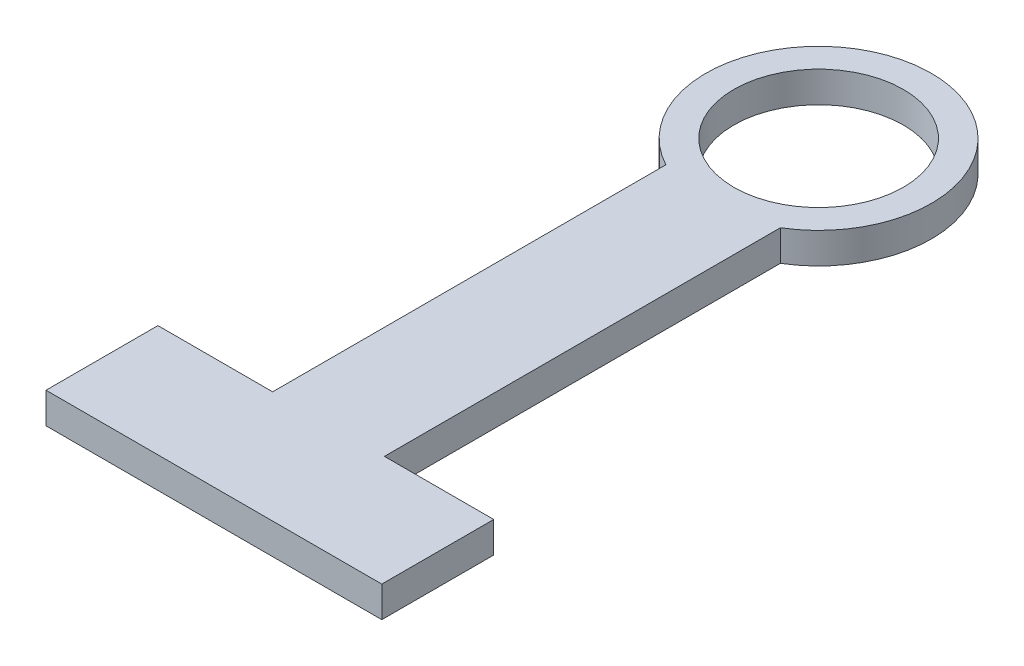
ISO-10303-21;
HEADER;
FILE_DESCRIPTION(('STEP AP214'),'2;1');
FILE_NAME('part.step','',(''),(''),'','','');
FILE_SCHEMA(('AUTOMOTIVE_DESIGN { 1 0 10303 214 1 1 1 1 }'));
ENDSEC;
DATA;
#1=APPLICATION_CONTEXT('core data for automotive mechanical design processes');
#2=APPLICATION_PROTOCOL_DEFINITION('international standard','automotive_design',2000,#1);
#3=PRODUCT_CONTEXT('',#1,'mechanical');
#4=PRODUCT('Part','Part','',(#3));
#5=PRODUCT_RELATED_PRODUCT_CATEGORY('part','',(#4));
#6=PRODUCT_DEFINITION_FORMATION('','',#4);
#7=PRODUCT_DEFINITION_CONTEXT('part definition',#1,'design');
#8=PRODUCT_DEFINITION('design','',#6,#7);
#9=PRODUCT_DEFINITION_SHAPE('','',#8);
#10=(LENGTH_UNIT() NAMED_UNIT(*) SI_UNIT(.MILLI.,.METRE.));
#11=(NAMED_UNIT(*) PLANE_ANGLE_UNIT() SI_UNIT($,.RADIAN.));
#12=(NAMED_UNIT(*) SI_UNIT($,.STERADIAN.) SOLID_ANGLE_UNIT());
#13=UNCERTAINTY_MEASURE_WITH_UNIT(LENGTH_MEASURE(1.E-05),#10,'distance_accuracy_value','');
#14=(GEOMETRIC_REPRESENTATION_CONTEXT(3) GLOBAL_UNCERTAINTY_ASSIGNED_CONTEXT((#13)) GLOBAL_UNIT_ASSIGNED_CONTEXT((#10,
#11,#12)) REPRESENTATION_CONTEXT('',''));
#15=CARTESIAN_POINT('',(0.,0.,0.));
#16=DIRECTION('',(0.,0.,1.));
#17=DIRECTION('',(1.,0.,0.));
#18=AXIS2_PLACEMENT_3D('',#15,#16,#17);
#19=CARTESIAN_POINT('',(13.2312792284211,7.,0.));
#20=DIRECTION('',(1.,0.,0.));
#21=DIRECTION('',(0.,0.,-1.));
#22=AXIS2_PLACEMENT_3D('',#19,#20,#21);
#23=PLANE('',#22);
#24=DIRECTION('',(0.,0.,1.));
#25=VECTOR('',#24,1.);
#26=CARTESIAN_POINT('',(13.2312792284211,0.,0.));
#27=LINE('',#26,#25);
#28=CARTESIAN_POINT('',(13.2312792284211,0.,21.9044958907881));
#29=VERTEX_POINT('',#28);
#30=CARTESIAN_POINT('',(13.2312792284211,0.,111.76));
#31=VERTEX_POINT('',#30);
#32=EDGE_CURVE('E133',#29,#31,#27,.T.);
#33=ORIENTED_EDGE('',*,*,#32,.F.);
#34=DIRECTION('',(0.,-1.,0.));
#35=VECTOR('',#34,1.);
#36=CARTESIAN_POINT('',(13.2312792284211,7.,21.9044958907881));
#37=LINE('',#36,#35);
#38=CARTESIAN_POINT('',(13.2312792284211,7.,21.9044958907881));
#39=VERTEX_POINT('',#38);
#40=EDGE_CURVE('E11',#39,#29,#37,.T.);
#41=ORIENTED_EDGE('',*,*,#40,.F.);
#42=DIRECTION('',(0.,0.,1.));
#43=VECTOR('',#42,1.);
#44=CARTESIAN_POINT('',(13.2312792284211,7.,0.));
#45=LINE('',#44,#43);
#46=CARTESIAN_POINT('',(13.2312792284211,7.,111.76));
#47=VERTEX_POINT('',#46);
#48=EDGE_CURVE('E156',#39,#47,#45,.T.);
#49=ORIENTED_EDGE('',*,*,#48,.T.);
#50=DIRECTION('',(0.,-1.,0.));
#51=VECTOR('',#50,1.);
#52=CARTESIAN_POINT('',(13.2312792284211,7.,111.76));
#53=LINE('',#52,#51);
#54=EDGE_CURVE('E51',#47,#31,#53,.T.);
#55=ORIENTED_EDGE('',*,*,#54,.T.);
#56=EDGE_LOOP('',(#33,#41,#49,#55));
#57=FACE_BOUND('',#56,.T.);
#58=ADVANCED_FACE('F35',(#57),#23,.T.);
#59=CARTESIAN_POINT('',(0.,7.,0.));
#60=DIRECTION('',(0.,-1.,0.));
#61=DIRECTION('',(0.,0.,-1.));
#62=AXIS2_PLACEMENT_3D('',#59,#60,#61);
#63=CYLINDRICAL_SURFACE('',#62,25.5905);
#64=CARTESIAN_POINT('',(0.,0.,0.));
#65=DIRECTION('',(0.,1.,0.));
#66=DIRECTION('',(0.,0.,1.));
#67=AXIS2_PLACEMENT_3D('',#64,#65,#66);
#68=CIRCLE('',#67,25.5905);
#69=CARTESIAN_POINT('',(-12.1313903506888,0.,22.5322670499268));
#70=VERTEX_POINT('',#69);
#71=EDGE_CURVE('E135',#29,#70,#68,.T.);
#72=ORIENTED_EDGE('',*,*,#71,.T.);
#73=DIRECTION('',(0.,-1.,0.));
#74=VECTOR('',#73,1.);
#75=CARTESIAN_POINT('',(-12.1313903506888,7.,22.5322670499268));
#76=LINE('',#75,#74);
#77=CARTESIAN_POINT('',(-12.1313903506888,7.,22.5322670499268));
#78=VERTEX_POINT('',#77);
#79=EDGE_CURVE('E43',#78,#70,#76,.T.);
#80=ORIENTED_EDGE('',*,*,#79,.F.);
#81=CARTESIAN_POINT('',(0.,7.,0.));
#82=DIRECTION('',(0.,1.,0.));
#83=DIRECTION('',(0.,0.,1.));
#84=AXIS2_PLACEMENT_3D('',#81,#82,#83);
#85=CIRCLE('',#84,25.5905);
#86=EDGE_CURVE('E182',#39,#78,#85,.T.);
#87=ORIENTED_EDGE('',*,*,#86,.F.);
#88=ORIENTED_EDGE('',*,*,#40,.T.);
#89=EDGE_LOOP('',(#72,#80,#87,#88));
#90=FACE_BOUND('',#89,.T.);
#91=ADVANCED_FACE('F172',(#90),#63,.T.);
#92=CARTESIAN_POINT('',(-12.1313903506888,7.,0.));
#93=DIRECTION('',(-1.,0.,0.));
#94=DIRECTION('',(0.,0.,1.));
#95=AXIS2_PLACEMENT_3D('',#92,#93,#94);
#96=PLANE('',#95);
#97=DIRECTION('',(0.,0.,-1.));
#98=VECTOR('',#97,1.);
#99=CARTESIAN_POINT('',(-12.1313903506888,0.,0.));
#100=LINE('',#99,#98);
#101=CARTESIAN_POINT('',(-12.1313903506888,0.,111.76));
#102=VERTEX_POINT('',#101);
#103=EDGE_CURVE('E138',#102,#70,#100,.T.);
#104=ORIENTED_EDGE('',*,*,#103,.F.);
#105=DIRECTION('',(0.,-1.,0.));
#106=VECTOR('',#105,1.);
#107=CARTESIAN_POINT('',(-12.1313903506888,7.,111.76));
#108=LINE('',#107,#106);
#109=CARTESIAN_POINT('',(-12.1313903506888,7.,111.76));
#110=VERTEX_POINT('',#109);
#111=EDGE_CURVE('E162',#110,#102,#108,.T.);
#112=ORIENTED_EDGE('',*,*,#111,.F.);
#113=DIRECTION('',(0.,0.,-1.));
#114=VECTOR('',#113,1.);
#115=CARTESIAN_POINT('',(-12.1313903506888,7.,0.));
#116=LINE('',#115,#114);
#117=EDGE_CURVE('E169',#110,#78,#116,.T.);
#118=ORIENTED_EDGE('',*,*,#117,.T.);
#119=ORIENTED_EDGE('',*,*,#79,.T.);
#120=EDGE_LOOP('',(#104,#112,#118,#119));
#121=FACE_BOUND('',#120,.T.);
#122=ADVANCED_FACE('F167',(#121),#96,.T.);
#123=CARTESIAN_POINT('',(0.,7.,111.76));
#124=DIRECTION('',(0.,0.,-1.));
#125=DIRECTION('',(-1.,0.,0.));
#126=AXIS2_PLACEMENT_3D('',#123,#124,#125);
#127=PLANE('',#126);
#128=DIRECTION('',(1.,0.,0.));
#129=VECTOR('',#128,1.);
#130=CARTESIAN_POINT('',(0.,0.,111.76));
#131=LINE('',#130,#129);
#132=CARTESIAN_POINT('',(-38.1639458553506,0.,111.76));
#133=VERTEX_POINT('',#132);
#134=EDGE_CURVE('E141',#133,#102,#131,.T.);
#135=ORIENTED_EDGE('',*,*,#134,.F.);
#136=DIRECTION('',(0.,-1.,0.));
#137=VECTOR('',#136,1.);
#138=CARTESIAN_POINT('',(-38.1639458553506,7.,111.76));
#139=LINE('',#138,#137);
#140=CARTESIAN_POINT('',(-38.1639458553506,7.,111.76));
#141=VERTEX_POINT('',#140);
#142=EDGE_CURVE('E160',#141,#133,#139,.T.);
#143=ORIENTED_EDGE('',*,*,#142,.F.);
#144=DIRECTION('',(1.,0.,0.));
#145=VECTOR('',#144,1.);
#146=CARTESIAN_POINT('',(0.,7.,111.76));
#147=LINE('',#146,#145);
#148=EDGE_CURVE('E181',#141,#110,#147,.T.);
#149=ORIENTED_EDGE('',*,*,#148,.T.);
#150=ORIENTED_EDGE('',*,*,#111,.T.);
#151=EDGE_LOOP('',(#135,#143,#149,#150));
#152=FACE_BOUND('',#151,.T.);
#153=ADVANCED_FACE('F179',(#152),#127,.T.);
#154=CARTESIAN_POINT('',(-38.1639458553506,7.,0.));
#155=DIRECTION('',(-1.,0.,0.));
#156=DIRECTION('',(0.,0.,1.));
#157=AXIS2_PLACEMENT_3D('',#154,#155,#156);
#158=PLANE('',#157);
#159=DIRECTION('',(0.,0.,-1.));
#160=VECTOR('',#159,1.);
#161=CARTESIAN_POINT('',(-38.1639458553506,0.,0.));
#162=LINE('',#161,#160);
#163=CARTESIAN_POINT('',(-38.1639458553506,0.,137.16));
#164=VERTEX_POINT('',#163);
#165=EDGE_CURVE('E144',#164,#133,#162,.T.);
#166=ORIENTED_EDGE('',*,*,#165,.F.);
#167=DIRECTION('',(0.,-1.,0.));
#168=VECTOR('',#167,1.);
#169=CARTESIAN_POINT('',(-38.1639458553506,7.,137.16));
#170=LINE('',#169,#168);
#171=CARTESIAN_POINT('',(-38.1639458553506,7.,137.16));
#172=VERTEX_POINT('',#171);
#173=EDGE_CURVE('E110',#172,#164,#170,.T.);
#174=ORIENTED_EDGE('',*,*,#173,.F.);
#175=DIRECTION('',(0.,0.,-1.));
#176=VECTOR('',#175,1.);
#177=CARTESIAN_POINT('',(-38.1639458553506,7.,0.));
#178=LINE('',#177,#176);
#179=EDGE_CURVE('E122',#172,#141,#178,.T.);
#180=ORIENTED_EDGE('',*,*,#179,.T.);
#181=ORIENTED_EDGE('',*,*,#142,.T.);
#182=EDGE_LOOP('',(#166,#174,#180,#181));
#183=FACE_BOUND('',#182,.T.);
#184=ADVANCED_FACE('F188',(#183),#158,.T.);
#185=CARTESIAN_POINT('',(0.,7.,137.16));
#186=DIRECTION('',(0.,0.,1.));
#187=DIRECTION('',(1.,0.,0.));
#188=AXIS2_PLACEMENT_3D('',#185,#186,#187);
#189=PLANE('',#188);
#190=DIRECTION('',(-1.,0.,0.));
#191=VECTOR('',#190,1.);
#192=CARTESIAN_POINT('',(0.,0.,137.16));
#193=LINE('',#192,#191);
#194=CARTESIAN_POINT('',(38.0360541446494,0.,137.16));
#195=VERTEX_POINT('',#194);
#196=EDGE_CURVE('E106',#195,#164,#193,.T.);
#197=ORIENTED_EDGE('',*,*,#196,.F.);
#198=DIRECTION('',(0.,-1.,0.));
#199=VECTOR('',#198,1.);
#200=CARTESIAN_POINT('',(38.0360541446494,7.,137.16));
#201=LINE('',#200,#199);
#202=CARTESIAN_POINT('',(38.0360541446494,7.,137.16));
#203=VERTEX_POINT('',#202);
#204=EDGE_CURVE('E101',#203,#195,#201,.T.);
#205=ORIENTED_EDGE('',*,*,#204,.F.);
#206=DIRECTION('',(-1.,0.,0.));
#207=VECTOR('',#206,1.);
#208=CARTESIAN_POINT('',(0.,7.,137.16));
#209=LINE('',#208,#207);
#210=EDGE_CURVE('E104',#203,#172,#209,.T.);
#211=ORIENTED_EDGE('',*,*,#210,.T.);
#212=ORIENTED_EDGE('',*,*,#173,.T.);
#213=EDGE_LOOP('',(#197,#205,#211,#212));
#214=FACE_BOUND('',#213,.T.);
#215=ADVANCED_FACE('F103',(#214),#189,.T.);
#216=CARTESIAN_POINT('',(38.0360541446494,7.,0.));
#217=DIRECTION('',(1.,0.,0.));
#218=DIRECTION('',(0.,0.,-1.));
#219=AXIS2_PLACEMENT_3D('',#216,#217,#218);
#220=PLANE('',#219);
#221=DIRECTION('',(0.,0.,1.));
#222=VECTOR('',#221,1.);
#223=CARTESIAN_POINT('',(38.0360541446494,0.,0.));
#224=LINE('',#223,#222);
#225=CARTESIAN_POINT('',(38.0360541446494,0.,111.76));
#226=VERTEX_POINT('',#225);
#227=EDGE_CURVE('E148',#226,#195,#224,.T.);
#228=ORIENTED_EDGE('',*,*,#227,.F.);
#229=DIRECTION('',(0.,-1.,0.));
#230=VECTOR('',#229,1.);
#231=CARTESIAN_POINT('',(38.0360541446494,7.,111.76));
#232=LINE('',#231,#230);
#233=CARTESIAN_POINT('',(38.0360541446494,7.,111.76));
#234=VERTEX_POINT('',#233);
#235=EDGE_CURVE('E76',#234,#226,#232,.T.);
#236=ORIENTED_EDGE('',*,*,#235,.F.);
#237=DIRECTION('',(0.,0.,1.));
#238=VECTOR('',#237,1.);
#239=CARTESIAN_POINT('',(38.0360541446494,7.,0.));
#240=LINE('',#239,#238);
#241=EDGE_CURVE('E119',#234,#203,#240,.T.);
#242=ORIENTED_EDGE('',*,*,#241,.T.);
#243=ORIENTED_EDGE('',*,*,#204,.T.);
#244=EDGE_LOOP('',(#228,#236,#242,#243));
#245=FACE_BOUND('',#244,.T.);
#246=ADVANCED_FACE('F124',(#245),#220,.T.);
#247=CARTESIAN_POINT('',(0.,7.,111.76));
#248=DIRECTION('',(0.,0.,-1.));
#249=DIRECTION('',(-1.,0.,0.));
#250=AXIS2_PLACEMENT_3D('',#247,#248,#249);
#251=PLANE('',#250);
#252=DIRECTION('',(1.,0.,0.));
#253=VECTOR('',#252,1.);
#254=CARTESIAN_POINT('',(0.,0.,111.76));
#255=LINE('',#254,#253);
#256=EDGE_CURVE('E150',#31,#226,#255,.T.);
#257=ORIENTED_EDGE('',*,*,#256,.F.);
#258=ORIENTED_EDGE('',*,*,#54,.F.);
#259=DIRECTION('',(1.,0.,0.));
#260=VECTOR('',#259,1.);
#261=CARTESIAN_POINT('',(0.,7.,111.76));
#262=LINE('',#261,#260);
#263=EDGE_CURVE('E125',#47,#234,#262,.T.);
#264=ORIENTED_EDGE('',*,*,#263,.T.);
#265=ORIENTED_EDGE('',*,*,#235,.T.);
#266=EDGE_LOOP('',(#257,#258,#264,#265));
#267=FACE_BOUND('',#266,.T.);
#268=ADVANCED_FACE('F189',(#267),#251,.T.);
#269=CARTESIAN_POINT('',(0.,7.,0.));
#270=DIRECTION('',(0.,-1.,0.));
#271=DIRECTION('',(0.,0.,-1.));
#272=AXIS2_PLACEMENT_3D('',#269,#270,#271);
#273=CYLINDRICAL_SURFACE('',#272,19.2405);
#274=CARTESIAN_POINT('',(0.,7.,0.));
#275=DIRECTION('',(0.,1.,0.));
#276=DIRECTION('',(0.,0.,1.));
#277=AXIS2_PLACEMENT_3D('',#274,#275,#276);
#278=CIRCLE('',#277,19.2405);
#279=CARTESIAN_POINT('',(0.,7.,19.2405));
#280=VERTEX_POINT('',#279);
#281=EDGE_CURVE('E127',#280,#280,#278,.T.);
#282=ORIENTED_EDGE('',*,*,#281,.T.);
#283=EDGE_LOOP('',(#282));
#284=FACE_BOUND('',#283,.T.);
#285=CARTESIAN_POINT('',(0.,0.,0.));
#286=DIRECTION('',(0.,1.,0.));
#287=DIRECTION('',(0.,0.,1.));
#288=AXIS2_PLACEMENT_3D('',#285,#286,#287);
#289=CIRCLE('',#288,19.2405);
#290=CARTESIAN_POINT('',(0.,0.,19.2405));
#291=VERTEX_POINT('',#290);
#292=EDGE_CURVE('E153',#291,#291,#289,.T.);
#293=ORIENTED_EDGE('',*,*,#292,.F.);
#294=EDGE_LOOP('',(#293));
#295=FACE_BOUND('',#294,.T.);
#296=ADVANCED_FACE('F191',(#284,#295),#273,.F.);
#297=CARTESIAN_POINT('',(0.,7.,0.));
#298=DIRECTION('',(0.,1.,0.));
#299=DIRECTION('',(0.,0.,1.));
#300=AXIS2_PLACEMENT_3D('',#297,#298,#299);
#301=PLANE('',#300);
#302=ORIENTED_EDGE('',*,*,#48,.F.);
#303=ORIENTED_EDGE('',*,*,#86,.T.);
#304=ORIENTED_EDGE('',*,*,#117,.F.);
#305=ORIENTED_EDGE('',*,*,#148,.F.);
#306=ORIENTED_EDGE('',*,*,#179,.F.);
#307=ORIENTED_EDGE('',*,*,#210,.F.);
#308=ORIENTED_EDGE('',*,*,#241,.F.);
#309=ORIENTED_EDGE('',*,*,#263,.F.);
#310=EDGE_LOOP('',(#302,#303,#304,#305,#306,#307,#308,#309));
#311=FACE_BOUND('',#310,.T.);
#312=ORIENTED_EDGE('',*,*,#281,.F.);
#313=EDGE_LOOP('',(#312));
#314=FACE_BOUND('',#313,.T.);
#315=ADVANCED_FACE('F116',(#311,#314),#301,.T.);
#316=CARTESIAN_POINT('',(0.,0.,0.));
#317=DIRECTION('',(0.,1.,0.));
#318=DIRECTION('',(0.,0.,1.));
#319=AXIS2_PLACEMENT_3D('',#316,#317,#318);
#320=PLANE('',#319);
#321=ORIENTED_EDGE('',*,*,#32,.T.);
#322=ORIENTED_EDGE('',*,*,#256,.T.);
#323=ORIENTED_EDGE('',*,*,#227,.T.);
#324=ORIENTED_EDGE('',*,*,#196,.T.);
#325=ORIENTED_EDGE('',*,*,#165,.T.);
#326=ORIENTED_EDGE('',*,*,#134,.T.);
#327=ORIENTED_EDGE('',*,*,#103,.T.);
#328=ORIENTED_EDGE('',*,*,#71,.F.);
#329=EDGE_LOOP('',(#321,#322,#323,#324,#325,#326,#327,#328));
#330=FACE_BOUND('',#329,.T.);
#331=ORIENTED_EDGE('',*,*,#292,.T.);
#332=EDGE_LOOP('',(#331));
#333=FACE_BOUND('',#332,.T.);
#334=ADVANCED_FACE('F174',(#330,#333),#320,.F.);
#335=CLOSED_SHELL('',(#58,#91,#122,#153,#184,#215,#246,#268,#296,#315,#334));
#336=MANIFOLD_SOLID_BREP('B2',#335);
#337=ADVANCED_BREP_SHAPE_REPRESENTATION('',(#18,#336),#14);
#338=SHAPE_DEFINITION_REPRESENTATION(#9,#337);
ENDSEC;
END-ISO-10303-21;
